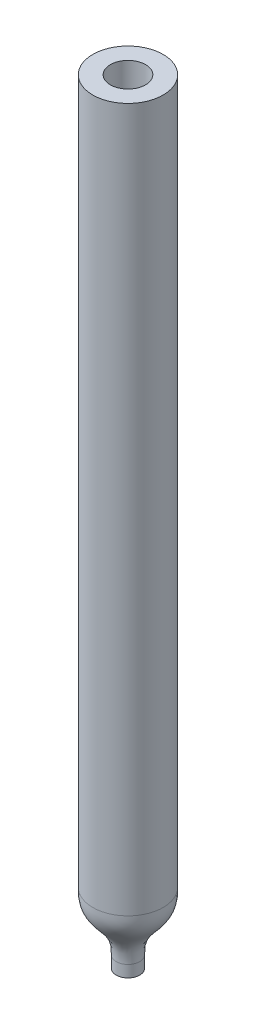
ISO-10303-21;
HEADER;
FILE_DESCRIPTION(('STEP AP214'),'2;1');
FILE_NAME('part.step','',(''),(''),'','','');
FILE_SCHEMA(('AUTOMOTIVE_DESIGN { 1 0 10303 214 1 1 1 1 }'));
ENDSEC;
DATA;
#1=APPLICATION_CONTEXT('core data for automotive mechanical design processes');
#2=APPLICATION_PROTOCOL_DEFINITION('international standard','automotive_design',2000,#1);
#3=PRODUCT_CONTEXT('',#1,'mechanical');
#4=PRODUCT('Part','Part','',(#3));
#5=PRODUCT_RELATED_PRODUCT_CATEGORY('part','',(#4));
#6=PRODUCT_DEFINITION_FORMATION('','',#4);
#7=PRODUCT_DEFINITION_CONTEXT('part definition',#1,'design');
#8=PRODUCT_DEFINITION('design','',#6,#7);
#9=PRODUCT_DEFINITION_SHAPE('','',#8);
#10=(LENGTH_UNIT() NAMED_UNIT(*) SI_UNIT(.MILLI.,.METRE.));
#11=(NAMED_UNIT(*) PLANE_ANGLE_UNIT() SI_UNIT($,.RADIAN.));
#12=(NAMED_UNIT(*) SI_UNIT($,.STERADIAN.) SOLID_ANGLE_UNIT());
#13=UNCERTAINTY_MEASURE_WITH_UNIT(LENGTH_MEASURE(1.E-05),#10,'distance_accuracy_value','');
#14=(GEOMETRIC_REPRESENTATION_CONTEXT(3) GLOBAL_UNCERTAINTY_ASSIGNED_CONTEXT((#13)) GLOBAL_UNIT_ASSIGNED_CONTEXT((#10,
#11,#12)) REPRESENTATION_CONTEXT('',''));
#15=CARTESIAN_POINT('',(0.,0.,0.));
#16=DIRECTION('',(0.,0.,1.));
#17=DIRECTION('',(1.,0.,0.));
#18=AXIS2_PLACEMENT_3D('',#15,#16,#17);
#19=CARTESIAN_POINT('',(0.,0.,0.));
#20=DIRECTION('',(0.,1.,0.));
#21=DIRECTION('',(0.,0.,1.));
#22=AXIS2_PLACEMENT_3D('',#19,#20,#21);
#23=CYLINDRICAL_SURFACE('',#22,1.5);
#24=CARTESIAN_POINT('',(0.,0.,0.));
#25=DIRECTION('',(0.,1.,0.));
#26=DIRECTION('',(0.,0.,1.));
#27=AXIS2_PLACEMENT_3D('',#24,#25,#26);
#28=CIRCLE('',#27,1.5);
#29=CARTESIAN_POINT('',(0.,0.,1.5));
#30=VERTEX_POINT('',#29);
#31=EDGE_CURVE('E10',#30,#30,#28,.T.);
#32=ORIENTED_EDGE('',*,*,#31,.F.);
#33=EDGE_LOOP('',(#32));
#34=FACE_BOUND('',#33,.T.);
#35=CARTESIAN_POINT('',(0.,61.,0.));
#36=DIRECTION('',(0.,1.,0.));
#37=DIRECTION('',(0.,0.,1.));
#38=AXIS2_PLACEMENT_3D('',#35,#36,#37);
#39=CIRCLE('',#38,1.49999999999999);
#40=CARTESIAN_POINT('',(0.,61.,1.49999999999999));
#41=VERTEX_POINT('',#40);
#42=EDGE_CURVE('E59',#41,#41,#39,.T.);
#43=ORIENTED_EDGE('',*,*,#42,.T.);
#44=EDGE_LOOP('',(#43));
#45=FACE_BOUND('',#44,.T.);
#46=ADVANCED_FACE('F31',(#34,#45),#23,.F.);
#47=CARTESIAN_POINT('',(1.5,0.,0.));
#48=CARTESIAN_POINT('',(1.5,-1.12985305159183,0.));
#49=CARTESIAN_POINT('',(1.50000000000001,-2.25970610318353,0.));
#50=CARTESIAN_POINT('',(0.249999999999992,-1.74029389681622,0.));
#51=CARTESIAN_POINT('',(0.25,-2.87014694840817,0.));
#52=CARTESIAN_POINT('',(0.25,-4.,0.));
#53=B_SPLINE_CURVE_WITH_KNOTS('',5,(#47,#48,#49,#50,#51,#52),.UNSPECIFIED.,.F.,.F.,(6,6),(0.,
1.),.UNSPECIFIED.);
#54=CARTESIAN_POINT('',(0.,0.,0.));
#55=DIRECTION('',(0.,1.,0.));
#56=AXIS1_PLACEMENT('',#54,#55);
#57=SURFACE_OF_REVOLUTION('',#53,#56);
#58=CARTESIAN_POINT('',(0.,-4.,0.));
#59=DIRECTION('',(0.,1.,0.));
#60=DIRECTION('',(0.,0.,1.));
#61=AXIS2_PLACEMENT_3D('',#58,#59,#60);
#62=CIRCLE('',#61,0.25);
#63=CARTESIAN_POINT('',(0.,-4.,0.25));
#64=VERTEX_POINT('',#63);
#65=EDGE_CURVE('E37',#64,#64,#62,.T.);
#66=ORIENTED_EDGE('',*,*,#65,.F.);
#67=EDGE_LOOP('',(#66));
#68=FACE_BOUND('',#67,.T.);
#69=ORIENTED_EDGE('',*,*,#31,.T.);
#70=EDGE_LOOP('',(#69));
#71=FACE_BOUND('',#70,.T.);
#72=ADVANCED_FACE('F90',(#68,#71),#57,.T.);
#73=CARTESIAN_POINT('',(0.,0.,0.));
#74=DIRECTION('',(0.,1.,0.));
#75=DIRECTION('',(0.,0.,1.));
#76=AXIS2_PLACEMENT_3D('',#73,#74,#75);
#77=CYLINDRICAL_SURFACE('',#76,0.25);
#78=CARTESIAN_POINT('',(0.,-5.,0.));
#79=DIRECTION('',(0.,1.,0.));
#80=DIRECTION('',(0.,0.,1.));
#81=AXIS2_PLACEMENT_3D('',#78,#79,#80);
#82=CIRCLE('',#81,0.250000000000001);
#83=CARTESIAN_POINT('',(0.,-5.,0.250000000000001));
#84=VERTEX_POINT('',#83);
#85=EDGE_CURVE('E41',#84,#84,#82,.T.);
#86=ORIENTED_EDGE('',*,*,#85,.F.);
#87=EDGE_LOOP('',(#86));
#88=FACE_BOUND('',#87,.T.);
#89=ORIENTED_EDGE('',*,*,#65,.T.);
#90=EDGE_LOOP('',(#89));
#91=FACE_BOUND('',#90,.T.);
#92=ADVANCED_FACE('F87',(#88,#91),#77,.F.);
#93=CARTESIAN_POINT('',(0.250000000000001,-5.,0.));
#94=DIRECTION('',(0.,1.,0.));
#95=DIRECTION('',(0.,0.,1.));
#96=AXIS2_PLACEMENT_3D('',#93,#94,#95);
#97=PLANE('',#96);
#98=CARTESIAN_POINT('',(0.,-5.,0.));
#99=DIRECTION('',(0.,1.,0.));
#100=DIRECTION('',(0.,0.,1.));
#101=AXIS2_PLACEMENT_3D('',#98,#99,#100);
#102=CIRCLE('',#101,1.);
#103=CARTESIAN_POINT('',(0.,-5.,1.));
#104=VERTEX_POINT('',#103);
#105=EDGE_CURVE('E45',#104,#104,#102,.T.);
#106=ORIENTED_EDGE('',*,*,#105,.F.);
#107=EDGE_LOOP('',(#106));
#108=FACE_BOUND('',#107,.T.);
#109=ORIENTED_EDGE('',*,*,#85,.T.);
#110=EDGE_LOOP('',(#109));
#111=FACE_BOUND('',#110,.T.);
#112=ADVANCED_FACE('F83',(#108,#111),#97,.F.);
#113=CARTESIAN_POINT('',(0.,0.,0.));
#114=DIRECTION('',(0.,1.,0.));
#115=DIRECTION('',(0.,0.,1.));
#116=AXIS2_PLACEMENT_3D('',#113,#114,#115);
#117=CYLINDRICAL_SURFACE('',#116,1.);
#118=CARTESIAN_POINT('',(0.,-4.,0.));
#119=DIRECTION('',(0.,1.,0.));
#120=DIRECTION('',(0.,0.,1.));
#121=AXIS2_PLACEMENT_3D('',#118,#119,#120);
#122=CIRCLE('',#121,1.);
#123=CARTESIAN_POINT('',(0.,-4.,1.));
#124=VERTEX_POINT('',#123);
#125=EDGE_CURVE('E50',#124,#124,#122,.T.);
#126=ORIENTED_EDGE('',*,*,#125,.F.);
#127=EDGE_LOOP('',(#126));
#128=FACE_BOUND('',#127,.T.);
#129=ORIENTED_EDGE('',*,*,#105,.T.);
#130=EDGE_LOOP('',(#129));
#131=FACE_BOUND('',#130,.T.);
#132=ADVANCED_FACE('F78',(#128,#131),#117,.T.);
#133=CARTESIAN_POINT('',(1.,-4.,0.));
#134=CARTESIAN_POINT('',(1.,-2.85232622359341,0.));
#135=CARTESIAN_POINT('',(1.,-1.70465244718682,0.));
#136=CARTESIAN_POINT('',(2.99999999999999,-1.29534755281312,0.));
#137=CARTESIAN_POINT('',(3.,-0.14767377640659,0.));
#138=CARTESIAN_POINT('',(3.,1.,0.));
#139=B_SPLINE_CURVE_WITH_KNOTS('',5,(#133,#134,#135,#136,#137,#138),.UNSPECIFIED.,.F.,.F.,(6,6),
(0.,1.),.UNSPECIFIED.);
#140=CARTESIAN_POINT('',(0.,0.,0.));
#141=DIRECTION('',(0.,1.,0.));
#142=AXIS1_PLACEMENT('',#140,#141);
#143=SURFACE_OF_REVOLUTION('',#139,#142);
#144=CARTESIAN_POINT('',(0.,1.,0.));
#145=DIRECTION('',(0.,1.,0.));
#146=DIRECTION('',(0.,0.,1.));
#147=AXIS2_PLACEMENT_3D('',#144,#145,#146);
#148=CIRCLE('',#147,3.);
#149=CARTESIAN_POINT('',(0.,1.,3.));
#150=VERTEX_POINT('',#149);
#151=EDGE_CURVE('E53',#150,#150,#148,.T.);
#152=ORIENTED_EDGE('',*,*,#151,.F.);
#153=EDGE_LOOP('',(#152));
#154=FACE_BOUND('',#153,.T.);
#155=ORIENTED_EDGE('',*,*,#125,.T.);
#156=EDGE_LOOP('',(#155));
#157=FACE_BOUND('',#156,.T.);
#158=ADVANCED_FACE('F73',(#154,#157),#143,.T.);
#159=CARTESIAN_POINT('',(0.,0.,0.));
#160=DIRECTION('',(0.,1.,0.));
#161=DIRECTION('',(0.,0.,1.));
#162=AXIS2_PLACEMENT_3D('',#159,#160,#161);
#163=CYLINDRICAL_SURFACE('',#162,3.);
#164=CARTESIAN_POINT('',(0.,61.,0.));
#165=DIRECTION('',(0.,1.,0.));
#166=DIRECTION('',(0.,0.,1.));
#167=AXIS2_PLACEMENT_3D('',#164,#165,#166);
#168=CIRCLE('',#167,2.99999999999999);
#169=CARTESIAN_POINT('',(0.,61.,2.99999999999999));
#170=VERTEX_POINT('',#169);
#171=EDGE_CURVE('E56',#170,#170,#168,.T.);
#172=ORIENTED_EDGE('',*,*,#171,.F.);
#173=EDGE_LOOP('',(#172));
#174=FACE_BOUND('',#173,.T.);
#175=ORIENTED_EDGE('',*,*,#151,.T.);
#176=EDGE_LOOP('',(#175));
#177=FACE_BOUND('',#176,.T.);
#178=ADVANCED_FACE('F77',(#174,#177),#163,.T.);
#179=CARTESIAN_POINT('',(1.49999999999999,61.,0.));
#180=DIRECTION('',(0.,-1.,0.));
#181=DIRECTION('',(0.,0.,-1.));
#182=AXIS2_PLACEMENT_3D('',#179,#180,#181);
#183=PLANE('',#182);
#184=ORIENTED_EDGE('',*,*,#42,.F.);
#185=EDGE_LOOP('',(#184));
#186=FACE_BOUND('',#185,.T.);
#187=ORIENTED_EDGE('',*,*,#171,.T.);
#188=EDGE_LOOP('',(#187));
#189=FACE_BOUND('',#188,.T.);
#190=ADVANCED_FACE('F103',(#186,#189),#183,.F.);
#191=CLOSED_SHELL('',(#46,#72,#92,#112,#132,#158,#178,#190));
#192=MANIFOLD_SOLID_BREP('B2',#191);
#193=ADVANCED_BREP_SHAPE_REPRESENTATION('',(#18,#192),#14);
#194=SHAPE_DEFINITION_REPRESENTATION(#9,#193);
ENDSEC;
END-ISO-10303-21;
